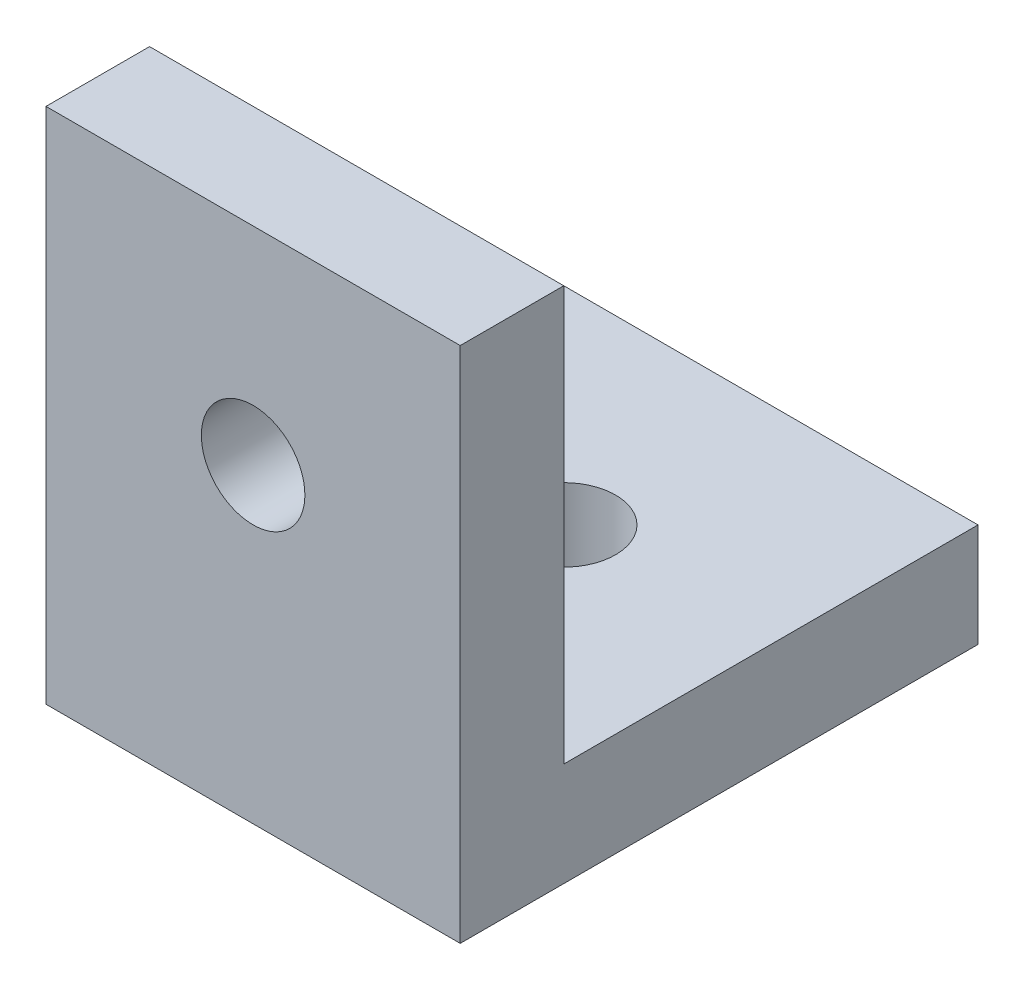
ISO-10303-21;
HEADER;
FILE_DESCRIPTION(('STEP AP214'),'2;1');
FILE_NAME('part.step','',(''),(''),'','','');
FILE_SCHEMA(('AUTOMOTIVE_DESIGN { 1 0 10303 214 1 1 1 1 }'));
ENDSEC;
DATA;
#1=APPLICATION_CONTEXT('core data for automotive mechanical design processes');
#2=APPLICATION_PROTOCOL_DEFINITION('international standard','automotive_design',2000,#1);
#3=PRODUCT_CONTEXT('',#1,'mechanical');
#4=PRODUCT('Part','Part','',(#3));
#5=PRODUCT_RELATED_PRODUCT_CATEGORY('part','',(#4));
#6=PRODUCT_DEFINITION_FORMATION('','',#4);
#7=PRODUCT_DEFINITION_CONTEXT('part definition',#1,'design');
#8=PRODUCT_DEFINITION('design','',#6,#7);
#9=PRODUCT_DEFINITION_SHAPE('','',#8);
#10=(LENGTH_UNIT() NAMED_UNIT(*) SI_UNIT(.MILLI.,.METRE.));
#11=(NAMED_UNIT(*) PLANE_ANGLE_UNIT() SI_UNIT($,.RADIAN.));
#12=(NAMED_UNIT(*) SI_UNIT($,.STERADIAN.) SOLID_ANGLE_UNIT());
#13=UNCERTAINTY_MEASURE_WITH_UNIT(LENGTH_MEASURE(1.E-05),#10,'distance_accuracy_value','');
#14=(GEOMETRIC_REPRESENTATION_CONTEXT(3) GLOBAL_UNCERTAINTY_ASSIGNED_CONTEXT((#13)) GLOBAL_UNIT_ASSIGNED_CONTEXT((#10,
#11,#12)) REPRESENTATION_CONTEXT('',''));
#15=CARTESIAN_POINT('',(0.,0.,0.));
#16=DIRECTION('',(0.,0.,1.));
#17=DIRECTION('',(1.,0.,0.));
#18=AXIS2_PLACEMENT_3D('',#15,#16,#17);
#19=CARTESIAN_POINT('',(20.,0.,-25.));
#20=DIRECTION('',(0.,1.,0.));
#21=DIRECTION('',(0.,0.,1.));
#22=AXIS2_PLACEMENT_3D('',#19,#20,#21);
#23=PLANE('',#22);
#24=CARTESIAN_POINT('',(10.,0.,-15.));
#25=DIRECTION('',(0.,1.,0.));
#26=DIRECTION('',(0.,0.,1.));
#27=AXIS2_PLACEMENT_3D('',#24,#25,#26);
#28=CIRCLE('',#27,2.5);
#29=CARTESIAN_POINT('',(10.,0.,-12.5));
#30=VERTEX_POINT('',#29);
#31=EDGE_CURVE('E139',#30,#30,#28,.T.);
#32=ORIENTED_EDGE('',*,*,#31,.T.);
#33=EDGE_LOOP('',(#32));
#34=FACE_BOUND('',#33,.T.);
#35=DIRECTION('',(0.,0.,-1.));
#36=VECTOR('',#35,1.);
#37=CARTESIAN_POINT('',(0.,0.,-25.));
#38=LINE('',#37,#36);
#39=CARTESIAN_POINT('',(0.,0.,0.));
#40=VERTEX_POINT('',#39);
#41=CARTESIAN_POINT('',(0.,0.,-25.));
#42=VERTEX_POINT('',#41);
#43=EDGE_CURVE('E134',#40,#42,#38,.T.);
#44=ORIENTED_EDGE('',*,*,#43,.T.);
#45=DIRECTION('',(-1.,0.,0.));
#46=VECTOR('',#45,1.);
#47=CARTESIAN_POINT('',(20.,0.,-25.));
#48=LINE('',#47,#46);
#49=CARTESIAN_POINT('',(20.,0.,-25.));
#50=VERTEX_POINT('',#49);
#51=EDGE_CURVE('E11',#50,#42,#48,.T.);
#52=ORIENTED_EDGE('',*,*,#51,.F.);
#53=DIRECTION('',(0.,0.,-1.));
#54=VECTOR('',#53,1.);
#55=CARTESIAN_POINT('',(20.,0.,-25.));
#56=LINE('',#55,#54);
#57=CARTESIAN_POINT('',(20.,0.,0.));
#58=VERTEX_POINT('',#57);
#59=EDGE_CURVE('E151',#58,#50,#56,.T.);
#60=ORIENTED_EDGE('',*,*,#59,.F.);
#61=DIRECTION('',(-1.,0.,0.));
#62=VECTOR('',#61,1.);
#63=CARTESIAN_POINT('',(20.,0.,0.));
#64=LINE('',#63,#62);
#65=EDGE_CURVE('E130',#58,#40,#64,.T.);
#66=ORIENTED_EDGE('',*,*,#65,.T.);
#67=EDGE_LOOP('',(#44,#52,#60,#66));
#68=FACE_BOUND('',#67,.T.);
#69=ADVANCED_FACE('F45',(#34,#68),#23,.F.);
#70=CARTESIAN_POINT('',(20.,5.,-25.));
#71=DIRECTION('',(0.,0.,1.));
#72=DIRECTION('',(1.,0.,0.));
#73=AXIS2_PLACEMENT_3D('',#70,#71,#72);
#74=PLANE('',#73);
#75=DIRECTION('',(0.,1.,0.));
#76=VECTOR('',#75,1.);
#77=CARTESIAN_POINT('',(0.,5.,-25.));
#78=LINE('',#77,#76);
#79=CARTESIAN_POINT('',(0.,5.,-25.));
#80=VERTEX_POINT('',#79);
#81=EDGE_CURVE('E138',#42,#80,#78,.T.);
#82=ORIENTED_EDGE('',*,*,#81,.T.);
#83=DIRECTION('',(-1.,0.,0.));
#84=VECTOR('',#83,1.);
#85=CARTESIAN_POINT('',(20.,5.,-25.));
#86=LINE('',#85,#84);
#87=CARTESIAN_POINT('',(20.,5.,-25.));
#88=VERTEX_POINT('',#87);
#89=EDGE_CURVE('E54',#88,#80,#86,.T.);
#90=ORIENTED_EDGE('',*,*,#89,.F.);
#91=DIRECTION('',(0.,1.,0.));
#92=VECTOR('',#91,1.);
#93=CARTESIAN_POINT('',(20.,5.,-25.));
#94=LINE('',#93,#92);
#95=EDGE_CURVE('E99',#50,#88,#94,.T.);
#96=ORIENTED_EDGE('',*,*,#95,.F.);
#97=ORIENTED_EDGE('',*,*,#51,.T.);
#98=EDGE_LOOP('',(#82,#90,#96,#97));
#99=FACE_BOUND('',#98,.T.);
#100=ADVANCED_FACE('F183',(#99),#74,.F.);
#101=CARTESIAN_POINT('',(20.,4.99999999999999,-5.00000000000001));
#102=DIRECTION('',(0.,-1.,0.));
#103=DIRECTION('',(0.,0.,-1.));
#104=AXIS2_PLACEMENT_3D('',#101,#102,#103);
#105=PLANE('',#104);
#106=CARTESIAN_POINT('',(10.,5.,-15.));
#107=DIRECTION('',(0.,1.,0.));
#108=DIRECTION('',(0.,0.,1.));
#109=AXIS2_PLACEMENT_3D('',#106,#107,#108);
#110=CIRCLE('',#109,2.5);
#111=CARTESIAN_POINT('',(10.,5.,-12.5));
#112=VERTEX_POINT('',#111);
#113=EDGE_CURVE('E194',#112,#112,#110,.T.);
#114=ORIENTED_EDGE('',*,*,#113,.F.);
#115=EDGE_LOOP('',(#114));
#116=FACE_BOUND('',#115,.T.);
#117=DIRECTION('',(0.,0.,1.));
#118=VECTOR('',#117,1.);
#119=CARTESIAN_POINT('',(0.,4.99999999999999,-5.00000000000001));
#120=LINE('',#119,#118);
#121=CARTESIAN_POINT('',(0.,4.99999999999999,-5.00000000000001));
#122=VERTEX_POINT('',#121);
#123=EDGE_CURVE('E142',#80,#122,#120,.T.);
#124=ORIENTED_EDGE('',*,*,#123,.T.);
#125=DIRECTION('',(-1.,0.,0.));
#126=VECTOR('',#125,1.);
#127=CARTESIAN_POINT('',(20.,4.99999999999999,-5.00000000000001));
#128=LINE('',#127,#126);
#129=CARTESIAN_POINT('',(20.,4.99999999999999,-5.00000000000001));
#130=VERTEX_POINT('',#129);
#131=EDGE_CURVE('E123',#130,#122,#128,.T.);
#132=ORIENTED_EDGE('',*,*,#131,.F.);
#133=DIRECTION('',(0.,0.,1.));
#134=VECTOR('',#133,1.);
#135=CARTESIAN_POINT('',(20.,4.99999999999999,-5.00000000000001));
#136=LINE('',#135,#134);
#137=EDGE_CURVE('E112',#88,#130,#136,.T.);
#138=ORIENTED_EDGE('',*,*,#137,.F.);
#139=ORIENTED_EDGE('',*,*,#89,.T.);
#140=EDGE_LOOP('',(#124,#132,#138,#139));
#141=FACE_BOUND('',#140,.T.);
#142=ADVANCED_FACE('F161',(#116,#141),#105,.F.);
#143=CARTESIAN_POINT('',(20.,25.,-5.));
#144=DIRECTION('',(0.,0.,1.));
#145=DIRECTION('',(0.,-1.,0.));
#146=AXIS2_PLACEMENT_3D('',#143,#144,#145);
#147=PLANE('',#146);
#148=CARTESIAN_POINT('',(10.,15.,-5.));
#149=DIRECTION('',(0.,0.,-1.));
#150=DIRECTION('',(0.,1.,0.));
#151=AXIS2_PLACEMENT_3D('',#148,#149,#150);
#152=CIRCLE('',#151,2.5);
#153=CARTESIAN_POINT('',(10.,17.5,-5.));
#154=VERTEX_POINT('',#153);
#155=EDGE_CURVE('E201',#154,#154,#152,.T.);
#156=ORIENTED_EDGE('',*,*,#155,.F.);
#157=EDGE_LOOP('',(#156));
#158=FACE_BOUND('',#157,.T.);
#159=DIRECTION('',(0.,1.,0.));
#160=VECTOR('',#159,1.);
#161=CARTESIAN_POINT('',(0.,25.,-5.));
#162=LINE('',#161,#160);
#163=CARTESIAN_POINT('',(0.,25.,-5.));
#164=VERTEX_POINT('',#163);
#165=EDGE_CURVE('E121',#122,#164,#162,.T.);
#166=ORIENTED_EDGE('',*,*,#165,.T.);
#167=DIRECTION('',(-1.,0.,0.));
#168=VECTOR('',#167,1.);
#169=CARTESIAN_POINT('',(20.,25.,-5.));
#170=LINE('',#169,#168);
#171=CARTESIAN_POINT('',(20.,25.,-5.));
#172=VERTEX_POINT('',#171);
#173=EDGE_CURVE('E118',#172,#164,#170,.T.);
#174=ORIENTED_EDGE('',*,*,#173,.F.);
#175=DIRECTION('',(0.,1.,0.));
#176=VECTOR('',#175,1.);
#177=CARTESIAN_POINT('',(20.,25.,-5.));
#178=LINE('',#177,#176);
#179=EDGE_CURVE('E106',#130,#172,#178,.T.);
#180=ORIENTED_EDGE('',*,*,#179,.F.);
#181=ORIENTED_EDGE('',*,*,#131,.T.);
#182=EDGE_LOOP('',(#166,#174,#180,#181));
#183=FACE_BOUND('',#182,.T.);
#184=ADVANCED_FACE('F119',(#158,#183),#147,.F.);
#185=CARTESIAN_POINT('',(20.,25.,0.));
#186=DIRECTION('',(0.,-1.,0.));
#187=DIRECTION('',(0.,0.,-1.));
#188=AXIS2_PLACEMENT_3D('',#185,#186,#187);
#189=PLANE('',#188);
#190=DIRECTION('',(0.,0.,1.));
#191=VECTOR('',#190,1.);
#192=CARTESIAN_POINT('',(0.,25.,0.));
#193=LINE('',#192,#191);
#194=CARTESIAN_POINT('',(0.,25.,0.));
#195=VERTEX_POINT('',#194);
#196=EDGE_CURVE('E85',#164,#195,#193,.T.);
#197=ORIENTED_EDGE('',*,*,#196,.T.);
#198=DIRECTION('',(-1.,0.,0.));
#199=VECTOR('',#198,1.);
#200=CARTESIAN_POINT('',(20.,25.,0.));
#201=LINE('',#200,#199);
#202=CARTESIAN_POINT('',(20.,25.,0.));
#203=VERTEX_POINT('',#202);
#204=EDGE_CURVE('E124',#203,#195,#201,.T.);
#205=ORIENTED_EDGE('',*,*,#204,.F.);
#206=DIRECTION('',(0.,0.,1.));
#207=VECTOR('',#206,1.);
#208=CARTESIAN_POINT('',(20.,25.,0.));
#209=LINE('',#208,#207);
#210=EDGE_CURVE('E110',#172,#203,#209,.T.);
#211=ORIENTED_EDGE('',*,*,#210,.F.);
#212=ORIENTED_EDGE('',*,*,#173,.T.);
#213=EDGE_LOOP('',(#197,#205,#211,#212));
#214=FACE_BOUND('',#213,.T.);
#215=ADVANCED_FACE('F126',(#214),#189,.F.);
#216=CARTESIAN_POINT('',(20.,0.,0.));
#217=DIRECTION('',(0.,0.,-1.));
#218=DIRECTION('',(-1.,0.,0.));
#219=AXIS2_PLACEMENT_3D('',#216,#217,#218);
#220=PLANE('',#219);
#221=CARTESIAN_POINT('',(10.,15.,0.));
#222=DIRECTION('',(0.,0.,-1.));
#223=DIRECTION('',(0.,1.,0.));
#224=AXIS2_PLACEMENT_3D('',#221,#222,#223);
#225=CIRCLE('',#224,2.5);
#226=CARTESIAN_POINT('',(10.,17.5,0.));
#227=VERTEX_POINT('',#226);
#228=EDGE_CURVE('E198',#227,#227,#225,.T.);
#229=ORIENTED_EDGE('',*,*,#228,.T.);
#230=EDGE_LOOP('',(#229));
#231=FACE_BOUND('',#230,.T.);
#232=DIRECTION('',(0.,-1.,0.));
#233=VECTOR('',#232,1.);
#234=CARTESIAN_POINT('',(0.,0.,0.));
#235=LINE('',#234,#233);
#236=EDGE_CURVE('E91',#195,#40,#235,.T.);
#237=ORIENTED_EDGE('',*,*,#236,.T.);
#238=ORIENTED_EDGE('',*,*,#65,.F.);
#239=DIRECTION('',(0.,-1.,0.));
#240=VECTOR('',#239,1.);
#241=CARTESIAN_POINT('',(20.,0.,0.));
#242=LINE('',#241,#240);
#243=EDGE_CURVE('E62',#203,#58,#242,.T.);
#244=ORIENTED_EDGE('',*,*,#243,.F.);
#245=ORIENTED_EDGE('',*,*,#204,.T.);
#246=EDGE_LOOP('',(#237,#238,#244,#245));
#247=FACE_BOUND('',#246,.T.);
#248=ADVANCED_FACE('F168',(#231,#247),#220,.F.);
#249=CARTESIAN_POINT('',(20.,0.,0.));
#250=DIRECTION('',(-1.,0.,0.));
#251=DIRECTION('',(0.,0.,1.));
#252=AXIS2_PLACEMENT_3D('',#249,#250,#251);
#253=PLANE('',#252);
#254=ORIENTED_EDGE('',*,*,#59,.T.);
#255=ORIENTED_EDGE('',*,*,#95,.T.);
#256=ORIENTED_EDGE('',*,*,#137,.T.);
#257=ORIENTED_EDGE('',*,*,#179,.T.);
#258=ORIENTED_EDGE('',*,*,#210,.T.);
#259=ORIENTED_EDGE('',*,*,#243,.T.);
#260=EDGE_LOOP('',(#254,#255,#256,#257,#258,#259));
#261=FACE_BOUND('',#260,.T.);
#262=ADVANCED_FACE('F108',(#261),#253,.F.);
#263=CARTESIAN_POINT('',(0.,0.,0.));
#264=DIRECTION('',(-1.,0.,0.));
#265=DIRECTION('',(0.,0.,1.));
#266=AXIS2_PLACEMENT_3D('',#263,#264,#265);
#267=PLANE('',#266);
#268=ORIENTED_EDGE('',*,*,#43,.F.);
#269=ORIENTED_EDGE('',*,*,#236,.F.);
#270=ORIENTED_EDGE('',*,*,#196,.F.);
#271=ORIENTED_EDGE('',*,*,#165,.F.);
#272=ORIENTED_EDGE('',*,*,#123,.F.);
#273=ORIENTED_EDGE('',*,*,#81,.F.);
#274=EDGE_LOOP('',(#268,#269,#270,#271,#272,#273));
#275=FACE_BOUND('',#274,.T.);
#276=ADVANCED_FACE('F164',(#275),#267,.T.);
#277=CARTESIAN_POINT('',(10.,0.,-15.));
#278=DIRECTION('',(0.,1.,0.));
#279=DIRECTION('',(0.,0.,1.));
#280=AXIS2_PLACEMENT_3D('',#277,#278,#279);
#281=CYLINDRICAL_SURFACE('',#280,2.5);
#282=ORIENTED_EDGE('',*,*,#31,.F.);
#283=EDGE_LOOP('',(#282));
#284=FACE_BOUND('',#283,.T.);
#285=ORIENTED_EDGE('',*,*,#113,.T.);
#286=EDGE_LOOP('',(#285));
#287=FACE_BOUND('',#286,.T.);
#288=ADVANCED_FACE('F215',(#284,#287),#281,.F.);
#289=CARTESIAN_POINT('',(10.,15.,0.));
#290=DIRECTION('',(0.,0.,-1.));
#291=DIRECTION('',(0.,1.,0.));
#292=AXIS2_PLACEMENT_3D('',#289,#290,#291);
#293=CYLINDRICAL_SURFACE('',#292,2.5);
#294=ORIENTED_EDGE('',*,*,#228,.F.);
#295=EDGE_LOOP('',(#294));
#296=FACE_BOUND('',#295,.T.);
#297=ORIENTED_EDGE('',*,*,#155,.T.);
#298=EDGE_LOOP('',(#297));
#299=FACE_BOUND('',#298,.T.);
#300=ADVANCED_FACE('F213',(#296,#299),#293,.F.);
#301=CLOSED_SHELL('',(#69,#100,#142,#184,#215,#248,#262,#276,#288,#300));
#302=MANIFOLD_SOLID_BREP('B2',#301);
#303=ADVANCED_BREP_SHAPE_REPRESENTATION('',(#18,#302),#14);
#304=SHAPE_DEFINITION_REPRESENTATION(#9,#303);
ENDSEC;
END-ISO-10303-21;
